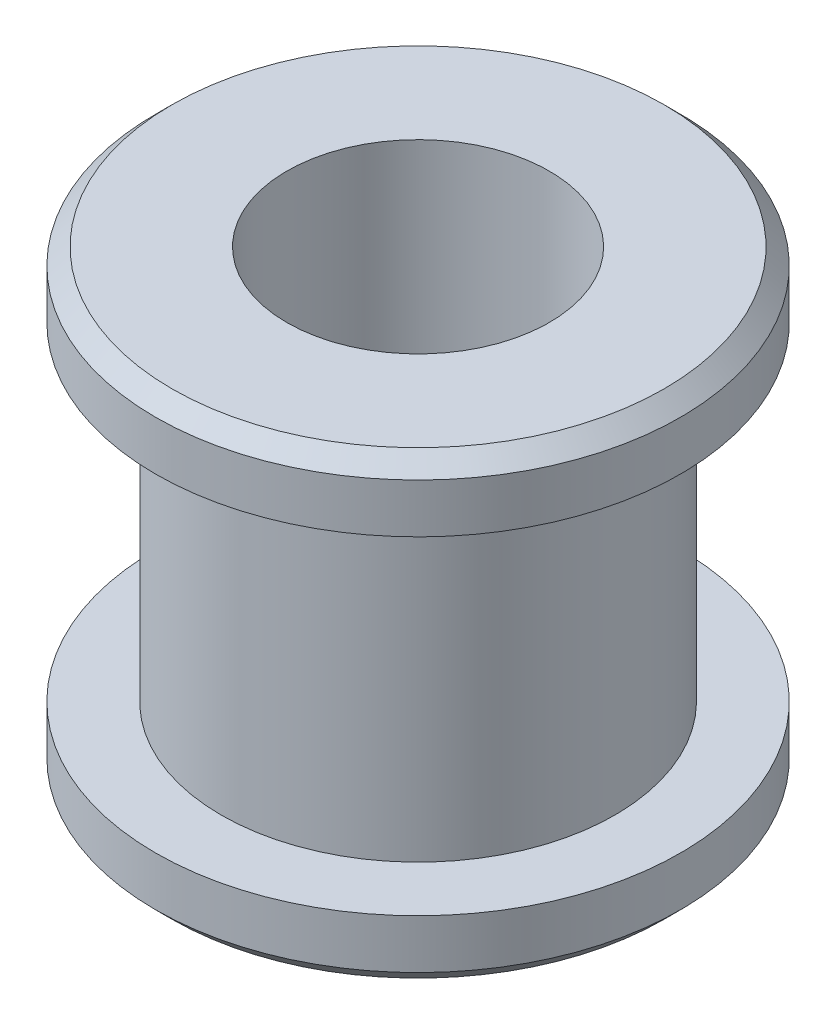
ISO-10303-21;
HEADER;
FILE_DESCRIPTION(('STEP AP214'),'2;1');
FILE_NAME('part.step','',(''),(''),'','','');
FILE_SCHEMA(('AUTOMOTIVE_DESIGN { 1 0 10303 214 1 1 1 1 }'));
ENDSEC;
DATA;
#1=APPLICATION_CONTEXT('core data for automotive mechanical design processes');
#2=APPLICATION_PROTOCOL_DEFINITION('international standard','automotive_design',2000,#1);
#3=PRODUCT_CONTEXT('',#1,'mechanical');
#4=PRODUCT('Part','Part','',(#3));
#5=PRODUCT_RELATED_PRODUCT_CATEGORY('part','',(#4));
#6=PRODUCT_DEFINITION_FORMATION('','',#4);
#7=PRODUCT_DEFINITION_CONTEXT('part definition',#1,'design');
#8=PRODUCT_DEFINITION('design','',#6,#7);
#9=PRODUCT_DEFINITION_SHAPE('','',#8);
#10=(LENGTH_UNIT() NAMED_UNIT(*) SI_UNIT(.MILLI.,.METRE.));
#11=(NAMED_UNIT(*) PLANE_ANGLE_UNIT() SI_UNIT($,.RADIAN.));
#12=(NAMED_UNIT(*) SI_UNIT($,.STERADIAN.) SOLID_ANGLE_UNIT());
#13=UNCERTAINTY_MEASURE_WITH_UNIT(LENGTH_MEASURE(1.E-05),#10,'distance_accuracy_value','');
#14=(GEOMETRIC_REPRESENTATION_CONTEXT(3) GLOBAL_UNCERTAINTY_ASSIGNED_CONTEXT((#13)) GLOBAL_UNIT_ASSIGNED_CONTEXT((#10,
#11,#12)) REPRESENTATION_CONTEXT('',''));
#15=CARTESIAN_POINT('',(0.,0.,0.));
#16=DIRECTION('',(0.,0.,1.));
#17=DIRECTION('',(1.,0.,0.));
#18=AXIS2_PLACEMENT_3D('',#15,#16,#17);
#19=CARTESIAN_POINT('',(0.,-2.,0.));
#20=DIRECTION('',(0.,1.,0.));
#21=DIRECTION('',(0.,0.,1.));
#22=AXIS2_PLACEMENT_3D('',#19,#20,#21);
#23=CYLINDRICAL_SURFACE('',#22,6.);
#24=CARTESIAN_POINT('',(0.,0.,0.));
#25=DIRECTION('',(0.,1.,0.));
#26=DIRECTION('',(0.,0.,1.));
#27=AXIS2_PLACEMENT_3D('',#24,#25,#26);
#28=CIRCLE('',#27,6.);
#29=CARTESIAN_POINT('',(0.,0.,6.));
#30=VERTEX_POINT('',#29);
#31=EDGE_CURVE('E68',#30,#30,#28,.F.);
#32=ORIENTED_EDGE('',*,*,#31,.F.);
#33=EDGE_LOOP('',(#32));
#34=FACE_BOUND('',#33,.T.);
#35=CARTESIAN_POINT('',(0.,10.,0.));
#36=DIRECTION('',(0.,1.,0.));
#37=DIRECTION('',(0.,0.,1.));
#38=AXIS2_PLACEMENT_3D('',#35,#36,#37);
#39=CIRCLE('',#38,6.);
#40=CARTESIAN_POINT('',(0.,10.,6.));
#41=VERTEX_POINT('',#40);
#42=EDGE_CURVE('E88',#41,#41,#39,.T.);
#43=ORIENTED_EDGE('',*,*,#42,.F.);
#44=EDGE_LOOP('',(#43));
#45=FACE_BOUND('',#44,.T.);
#46=ADVANCED_FACE('F43',(#34,#45),#23,.T.);
#47=CARTESIAN_POINT('',(0.,-2.,0.));
#48=DIRECTION('',(0.,1.,0.));
#49=DIRECTION('',(0.,0.,1.));
#50=AXIS2_PLACEMENT_3D('',#47,#48,#49);
#51=CYLINDRICAL_SURFACE('',#50,4.);
#52=CARTESIAN_POINT('',(0.,-2.,0.));
#53=DIRECTION('',(0.,1.,0.));
#54=DIRECTION('',(0.,0.,1.));
#55=AXIS2_PLACEMENT_3D('',#52,#53,#54);
#56=CIRCLE('',#55,4.);
#57=CARTESIAN_POINT('',(0.,-2.,4.));
#58=VERTEX_POINT('',#57);
#59=EDGE_CURVE('E72',#58,#58,#56,.T.);
#60=ORIENTED_EDGE('',*,*,#59,.F.);
#61=EDGE_LOOP('',(#60));
#62=FACE_BOUND('',#61,.T.);
#63=CARTESIAN_POINT('',(0.,12.,0.));
#64=DIRECTION('',(0.,1.,0.));
#65=DIRECTION('',(0.,0.,1.));
#66=AXIS2_PLACEMENT_3D('',#63,#64,#65);
#67=CIRCLE('',#66,4.);
#68=CARTESIAN_POINT('',(0.,12.,4.));
#69=VERTEX_POINT('',#68);
#70=EDGE_CURVE('E76',#69,#69,#67,.T.);
#71=ORIENTED_EDGE('',*,*,#70,.T.);
#72=EDGE_LOOP('',(#71));
#73=FACE_BOUND('',#72,.T.);
#74=ADVANCED_FACE('F97',(#62,#73),#51,.F.);
#75=CARTESIAN_POINT('',(0.,-2.,0.));
#76=DIRECTION('',(0.,1.,0.));
#77=DIRECTION('',(0.,0.,1.));
#78=AXIS2_PLACEMENT_3D('',#75,#76,#77);
#79=PLANE('',#78);
#80=CARTESIAN_POINT('',(0.,-2.,0.));
#81=DIRECTION('',(0.,1.,0.));
#82=DIRECTION('',(0.,0.,1.));
#83=AXIS2_PLACEMENT_3D('',#80,#81,#82);
#84=CIRCLE('',#83,7.5);
#85=CARTESIAN_POINT('',(0.,-2.,7.5));
#86=VERTEX_POINT('',#85);
#87=EDGE_CURVE('E57',#86,#86,#84,.F.);
#88=ORIENTED_EDGE('',*,*,#87,.T.);
#89=EDGE_LOOP('',(#88));
#90=FACE_BOUND('',#89,.T.);
#91=ORIENTED_EDGE('',*,*,#59,.T.);
#92=EDGE_LOOP('',(#91));
#93=FACE_BOUND('',#92,.T.);
#94=ADVANCED_FACE('F103',(#90,#93),#79,.F.);
#95=CARTESIAN_POINT('',(0.,12.,0.));
#96=DIRECTION('',(0.,1.,0.));
#97=DIRECTION('',(0.,0.,1.));
#98=AXIS2_PLACEMENT_3D('',#95,#96,#97);
#99=PLANE('',#98);
#100=CARTESIAN_POINT('',(0.,12.,0.));
#101=DIRECTION('',(0.,1.,0.));
#102=DIRECTION('',(0.,0.,1.));
#103=AXIS2_PLACEMENT_3D('',#100,#101,#102);
#104=CIRCLE('',#103,7.5);
#105=CARTESIAN_POINT('',(0.,12.,7.5));
#106=VERTEX_POINT('',#105);
#107=EDGE_CURVE('E52',#106,#106,#104,.T.);
#108=ORIENTED_EDGE('',*,*,#107,.T.);
#109=EDGE_LOOP('',(#108));
#110=FACE_BOUND('',#109,.T.);
#111=ORIENTED_EDGE('',*,*,#70,.F.);
#112=EDGE_LOOP('',(#111));
#113=FACE_BOUND('',#112,.T.);
#114=ADVANCED_FACE('F130',(#110,#113),#99,.T.);
#115=CARTESIAN_POINT('',(0.,-2.,0.));
#116=DIRECTION('',(0.,1.,0.));
#117=DIRECTION('',(0.,0.,1.));
#118=AXIS2_PLACEMENT_3D('',#115,#116,#117);
#119=CYLINDRICAL_SURFACE('',#118,8.);
#120=CARTESIAN_POINT('',(0.,-1.5,0.));
#121=DIRECTION('',(0.,1.,0.));
#122=DIRECTION('',(0.,0.,1.));
#123=AXIS2_PLACEMENT_3D('',#120,#121,#122);
#124=CIRCLE('',#123,8.);
#125=CARTESIAN_POINT('',(0.,-1.5,8.));
#126=VERTEX_POINT('',#125);
#127=EDGE_CURVE('E62',#126,#126,#124,.T.);
#128=ORIENTED_EDGE('',*,*,#127,.T.);
#129=EDGE_LOOP('',(#128));
#130=FACE_BOUND('',#129,.T.);
#131=CARTESIAN_POINT('',(0.,0.,0.));
#132=DIRECTION('',(0.,1.,0.));
#133=DIRECTION('',(0.,0.,1.));
#134=AXIS2_PLACEMENT_3D('',#131,#132,#133);
#135=CIRCLE('',#134,8.);
#136=CARTESIAN_POINT('',(0.,0.,8.));
#137=VERTEX_POINT('',#136);
#138=EDGE_CURVE('E80',#137,#137,#135,.T.);
#139=ORIENTED_EDGE('',*,*,#138,.F.);
#140=EDGE_LOOP('',(#139));
#141=FACE_BOUND('',#140,.T.);
#142=ADVANCED_FACE('F126',(#130,#141),#119,.T.);
#143=CARTESIAN_POINT('',(0.,0.,0.));
#144=DIRECTION('',(0.,1.,0.));
#145=DIRECTION('',(0.,0.,1.));
#146=AXIS2_PLACEMENT_3D('',#143,#144,#145);
#147=PLANE('',#146);
#148=ORIENTED_EDGE('',*,*,#31,.T.);
#149=EDGE_LOOP('',(#148));
#150=FACE_BOUND('',#149,.T.);
#151=ORIENTED_EDGE('',*,*,#138,.T.);
#152=EDGE_LOOP('',(#151));
#153=FACE_BOUND('',#152,.T.);
#154=ADVANCED_FACE('F129',(#150,#153),#147,.T.);
#155=CARTESIAN_POINT('',(0.,12.,0.));
#156=DIRECTION('',(0.,-1.,0.));
#157=DIRECTION('',(0.,0.,-1.));
#158=AXIS2_PLACEMENT_3D('',#155,#156,#157);
#159=CYLINDRICAL_SURFACE('',#158,8.);
#160=CARTESIAN_POINT('',(0.,11.5,0.));
#161=DIRECTION('',(0.,1.,0.));
#162=DIRECTION('',(0.,0.,1.));
#163=AXIS2_PLACEMENT_3D('',#160,#161,#162);
#164=CIRCLE('',#163,8.);
#165=CARTESIAN_POINT('',(0.,11.5,8.));
#166=VERTEX_POINT('',#165);
#167=EDGE_CURVE('E10',#166,#166,#164,.F.);
#168=ORIENTED_EDGE('',*,*,#167,.T.);
#169=EDGE_LOOP('',(#168));
#170=FACE_BOUND('',#169,.T.);
#171=CARTESIAN_POINT('',(0.,10.,0.));
#172=DIRECTION('',(0.,1.,0.));
#173=DIRECTION('',(0.,0.,1.));
#174=AXIS2_PLACEMENT_3D('',#171,#172,#173);
#175=CIRCLE('',#174,8.);
#176=CARTESIAN_POINT('',(0.,10.,8.));
#177=VERTEX_POINT('',#176);
#178=EDGE_CURVE('E84',#177,#177,#175,.T.);
#179=ORIENTED_EDGE('',*,*,#178,.T.);
#180=EDGE_LOOP('',(#179));
#181=FACE_BOUND('',#180,.T.);
#182=ADVANCED_FACE('F120',(#170,#181),#159,.T.);
#183=CARTESIAN_POINT('',(0.,10.,0.));
#184=DIRECTION('',(0.,1.,0.));
#185=DIRECTION('',(0.,0.,1.));
#186=AXIS2_PLACEMENT_3D('',#183,#184,#185);
#187=PLANE('',#186);
#188=ORIENTED_EDGE('',*,*,#42,.T.);
#189=EDGE_LOOP('',(#188));
#190=FACE_BOUND('',#189,.T.);
#191=ORIENTED_EDGE('',*,*,#178,.F.);
#192=EDGE_LOOP('',(#191));
#193=FACE_BOUND('',#192,.T.);
#194=ADVANCED_FACE('F93',(#190,#193),#187,.F.);
#195=CARTESIAN_POINT('',(0.,-1.5,0.));
#196=DIRECTION('',(0.,1.,0.));
#197=DIRECTION('',(0.,0.,1.));
#198=AXIS2_PLACEMENT_3D('',#195,#196,#197);
#199=CONICAL_SURFACE('',#198,8.,0.78539816339745);
#200=ORIENTED_EDGE('',*,*,#87,.F.);
#201=EDGE_LOOP('',(#200));
#202=FACE_BOUND('',#201,.T.);
#203=ORIENTED_EDGE('',*,*,#127,.F.);
#204=EDGE_LOOP('',(#203));
#205=FACE_BOUND('',#204,.T.);
#206=ADVANCED_FACE('F110',(#202,#205),#199,.T.);
#207=CARTESIAN_POINT('',(0.,12.,0.));
#208=DIRECTION('',(0.,-1.,0.));
#209=DIRECTION('',(0.,0.,-1.));
#210=AXIS2_PLACEMENT_3D('',#207,#208,#209);
#211=CONICAL_SURFACE('',#210,7.5,0.785398163397448);
#212=ORIENTED_EDGE('',*,*,#167,.F.);
#213=EDGE_LOOP('',(#212));
#214=FACE_BOUND('',#213,.T.);
#215=ORIENTED_EDGE('',*,*,#107,.F.);
#216=EDGE_LOOP('',(#215));
#217=FACE_BOUND('',#216,.T.);
#218=ADVANCED_FACE('F46',(#214,#217),#211,.T.);
#219=CLOSED_SHELL('',(#46,#74,#94,#114,#142,#154,#182,#194,#206,#218));
#220=MANIFOLD_SOLID_BREP('B2',#219);
#221=ADVANCED_BREP_SHAPE_REPRESENTATION('',(#18,#220),#14);
#222=SHAPE_DEFINITION_REPRESENTATION(#9,#221);
ENDSEC;
END-ISO-10303-21;
